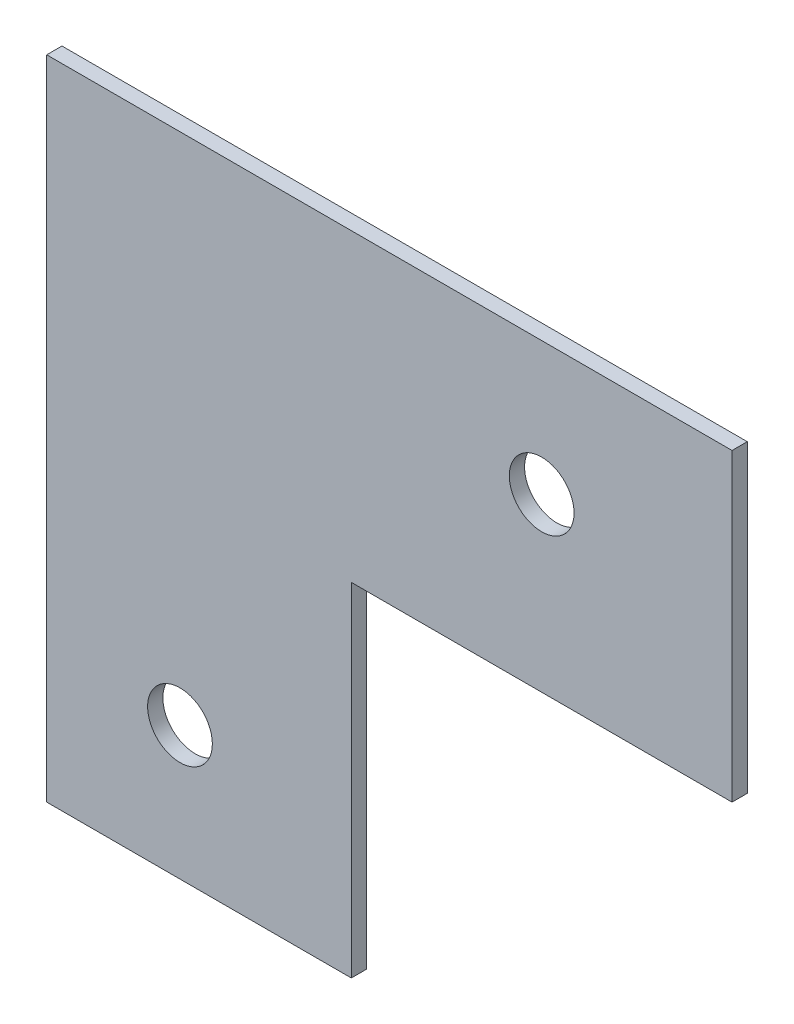
ISO-10303-21;
HEADER;
FILE_DESCRIPTION(('STEP AP214'),'2;1');
FILE_NAME('part.step','',(''),(''),'','','');
FILE_SCHEMA(('AUTOMOTIVE_DESIGN { 1 0 10303 214 1 1 1 1 }'));
ENDSEC;
DATA;
#1=APPLICATION_CONTEXT('core data for automotive mechanical design processes');
#2=APPLICATION_PROTOCOL_DEFINITION('international standard','automotive_design',2000,#1);
#3=PRODUCT_CONTEXT('',#1,'mechanical');
#4=PRODUCT('Part','Part','',(#3));
#5=PRODUCT_RELATED_PRODUCT_CATEGORY('part','',(#4));
#6=PRODUCT_DEFINITION_FORMATION('','',#4);
#7=PRODUCT_DEFINITION_CONTEXT('part definition',#1,'design');
#8=PRODUCT_DEFINITION('design','',#6,#7);
#9=PRODUCT_DEFINITION_SHAPE('','',#8);
#10=(LENGTH_UNIT() NAMED_UNIT(*) SI_UNIT(.MILLI.,.METRE.));
#11=(NAMED_UNIT(*) PLANE_ANGLE_UNIT() SI_UNIT($,.RADIAN.));
#12=(NAMED_UNIT(*) SI_UNIT($,.STERADIAN.) SOLID_ANGLE_UNIT());
#13=UNCERTAINTY_MEASURE_WITH_UNIT(LENGTH_MEASURE(1.E-05),#10,'distance_accuracy_value','');
#14=(GEOMETRIC_REPRESENTATION_CONTEXT(3) GLOBAL_UNCERTAINTY_ASSIGNED_CONTEXT((#13)) GLOBAL_UNIT_ASSIGNED_CONTEXT((#10,
#11,#12)) REPRESENTATION_CONTEXT('',''));
#15=CARTESIAN_POINT('',(0.,0.,0.));
#16=DIRECTION('',(0.,0.,1.));
#17=DIRECTION('',(1.,0.,0.));
#18=AXIS2_PLACEMENT_3D('',#15,#16,#17);
#19=CARTESIAN_POINT('',(40.,-45.,2.));
#20=DIRECTION('',(0.,1.,0.));
#21=DIRECTION('',(0.,0.,1.));
#22=AXIS2_PLACEMENT_3D('',#19,#20,#21);
#23=PLANE('',#22);
#24=DIRECTION('',(1.,0.,0.));
#25=VECTOR('',#24,1.);
#26=CARTESIAN_POINT('',(40.,-45.,0.));
#27=LINE('',#26,#25);
#28=CARTESIAN_POINT('',(0.,-45.,0.));
#29=VERTEX_POINT('',#28);
#30=CARTESIAN_POINT('',(40.,-45.,0.));
#31=VERTEX_POINT('',#30);
#32=EDGE_CURVE('E120',#29,#31,#27,.T.);
#33=ORIENTED_EDGE('',*,*,#32,.T.);
#34=DIRECTION('',(0.,0.,-1.));
#35=VECTOR('',#34,1.);
#36=CARTESIAN_POINT('',(40.,-45.,2.));
#37=LINE('',#36,#35);
#38=CARTESIAN_POINT('',(40.,-45.,2.));
#39=VERTEX_POINT('',#38);
#40=EDGE_CURVE('E40',#39,#31,#37,.T.);
#41=ORIENTED_EDGE('',*,*,#40,.F.);
#42=DIRECTION('',(1.,0.,0.));
#43=VECTOR('',#42,1.);
#44=CARTESIAN_POINT('',(40.,-45.,2.));
#45=LINE('',#44,#43);
#46=CARTESIAN_POINT('',(0.,-45.,2.));
#47=VERTEX_POINT('',#46);
#48=EDGE_CURVE('E86',#47,#39,#45,.T.);
#49=ORIENTED_EDGE('',*,*,#48,.F.);
#50=DIRECTION('',(0.,0.,-1.));
#51=VECTOR('',#50,1.);
#52=CARTESIAN_POINT('',(0.,-45.,2.));
#53=LINE('',#52,#51);
#54=EDGE_CURVE('E11',#47,#29,#53,.T.);
#55=ORIENTED_EDGE('',*,*,#54,.T.);
#56=EDGE_LOOP('',(#33,#41,#49,#55));
#57=FACE_BOUND('',#56,.T.);
#58=ADVANCED_FACE('F32',(#57),#23,.F.);
#59=CARTESIAN_POINT('',(40.,0.,2.));
#60=DIRECTION('',(-1.,0.,0.));
#61=DIRECTION('',(0.,-1.,0.));
#62=AXIS2_PLACEMENT_3D('',#59,#60,#61);
#63=PLANE('',#62);
#64=DIRECTION('',(0.,1.,0.));
#65=VECTOR('',#64,1.);
#66=CARTESIAN_POINT('',(40.,0.,0.));
#67=LINE('',#66,#65);
#68=CARTESIAN_POINT('',(40.,0.,0.));
#69=VERTEX_POINT('',#68);
#70=EDGE_CURVE('E122',#31,#69,#67,.T.);
#71=ORIENTED_EDGE('',*,*,#70,.T.);
#72=DIRECTION('',(0.,0.,-1.));
#73=VECTOR('',#72,1.);
#74=CARTESIAN_POINT('',(40.,0.,2.));
#75=LINE('',#74,#73);
#76=CARTESIAN_POINT('',(40.,0.,2.));
#77=VERTEX_POINT('',#76);
#78=EDGE_CURVE('E109',#77,#69,#75,.T.);
#79=ORIENTED_EDGE('',*,*,#78,.F.);
#80=DIRECTION('',(0.,1.,0.));
#81=VECTOR('',#80,1.);
#82=CARTESIAN_POINT('',(40.,0.,2.));
#83=LINE('',#82,#81);
#84=EDGE_CURVE('E100',#39,#77,#83,.T.);
#85=ORIENTED_EDGE('',*,*,#84,.F.);
#86=ORIENTED_EDGE('',*,*,#40,.T.);
#87=EDGE_LOOP('',(#71,#79,#85,#86));
#88=FACE_BOUND('',#87,.T.);
#89=ADVANCED_FACE('F135',(#88),#63,.F.);
#90=CARTESIAN_POINT('',(40.,0.,2.));
#91=DIRECTION('',(0.,1.,0.));
#92=DIRECTION('',(0.,0.,1.));
#93=AXIS2_PLACEMENT_3D('',#90,#91,#92);
#94=PLANE('',#93);
#95=DIRECTION('',(1.,0.,0.));
#96=VECTOR('',#95,1.);
#97=CARTESIAN_POINT('',(40.,0.,0.));
#98=LINE('',#97,#96);
#99=CARTESIAN_POINT('',(90.,0.,0.));
#100=VERTEX_POINT('',#99);
#101=EDGE_CURVE('E108',#69,#100,#98,.T.);
#102=ORIENTED_EDGE('',*,*,#101,.T.);
#103=DIRECTION('',(0.,0.,-1.));
#104=VECTOR('',#103,1.);
#105=CARTESIAN_POINT('',(90.,0.,2.));
#106=LINE('',#105,#104);
#107=CARTESIAN_POINT('',(90.,0.,2.));
#108=VERTEX_POINT('',#107);
#109=EDGE_CURVE('E105',#108,#100,#106,.T.);
#110=ORIENTED_EDGE('',*,*,#109,.F.);
#111=DIRECTION('',(1.,0.,0.));
#112=VECTOR('',#111,1.);
#113=CARTESIAN_POINT('',(40.,0.,2.));
#114=LINE('',#113,#112);
#115=EDGE_CURVE('E94',#77,#108,#114,.T.);
#116=ORIENTED_EDGE('',*,*,#115,.F.);
#117=ORIENTED_EDGE('',*,*,#78,.T.);
#118=EDGE_LOOP('',(#102,#110,#116,#117));
#119=FACE_BOUND('',#118,.T.);
#120=ADVANCED_FACE('F106',(#119),#94,.F.);
#121=CARTESIAN_POINT('',(90.,0.,2.));
#122=DIRECTION('',(-1.,0.,0.));
#123=DIRECTION('',(0.,0.,1.));
#124=AXIS2_PLACEMENT_3D('',#121,#122,#123);
#125=PLANE('',#124);
#126=DIRECTION('',(0.,1.,0.));
#127=VECTOR('',#126,1.);
#128=CARTESIAN_POINT('',(90.,0.,0.));
#129=LINE('',#128,#127);
#130=CARTESIAN_POINT('',(90.,40.,0.));
#131=VERTEX_POINT('',#130);
#132=EDGE_CURVE('E72',#100,#131,#129,.T.);
#133=ORIENTED_EDGE('',*,*,#132,.T.);
#134=DIRECTION('',(0.,0.,-1.));
#135=VECTOR('',#134,1.);
#136=CARTESIAN_POINT('',(90.,40.,2.));
#137=LINE('',#136,#135);
#138=CARTESIAN_POINT('',(90.,40.,2.));
#139=VERTEX_POINT('',#138);
#140=EDGE_CURVE('E110',#139,#131,#137,.T.);
#141=ORIENTED_EDGE('',*,*,#140,.F.);
#142=DIRECTION('',(0.,1.,0.));
#143=VECTOR('',#142,1.);
#144=CARTESIAN_POINT('',(90.,0.,2.));
#145=LINE('',#144,#143);
#146=EDGE_CURVE('E98',#108,#139,#145,.T.);
#147=ORIENTED_EDGE('',*,*,#146,.F.);
#148=ORIENTED_EDGE('',*,*,#109,.T.);
#149=EDGE_LOOP('',(#133,#141,#147,#148));
#150=FACE_BOUND('',#149,.T.);
#151=ADVANCED_FACE('F112',(#150),#125,.F.);
#152=CARTESIAN_POINT('',(90.,40.,2.));
#153=DIRECTION('',(0.,-1.,0.));
#154=DIRECTION('',(1.,0.,0.));
#155=AXIS2_PLACEMENT_3D('',#152,#153,#154);
#156=PLANE('',#155);
#157=DIRECTION('',(-1.,0.,0.));
#158=VECTOR('',#157,1.);
#159=CARTESIAN_POINT('',(90.,40.,0.));
#160=LINE('',#159,#158);
#161=CARTESIAN_POINT('',(0.,40.,0.));
#162=VERTEX_POINT('',#161);
#163=EDGE_CURVE('E79',#131,#162,#160,.T.);
#164=ORIENTED_EDGE('',*,*,#163,.T.);
#165=DIRECTION('',(0.,0.,-1.));
#166=VECTOR('',#165,1.);
#167=CARTESIAN_POINT('',(0.,40.,2.));
#168=LINE('',#167,#166);
#169=CARTESIAN_POINT('',(0.,40.,2.));
#170=VERTEX_POINT('',#169);
#171=EDGE_CURVE('E116',#170,#162,#168,.T.);
#172=ORIENTED_EDGE('',*,*,#171,.F.);
#173=DIRECTION('',(-1.,0.,0.));
#174=VECTOR('',#173,1.);
#175=CARTESIAN_POINT('',(90.,40.,2.));
#176=LINE('',#175,#174);
#177=EDGE_CURVE('E114',#139,#170,#176,.T.);
#178=ORIENTED_EDGE('',*,*,#177,.F.);
#179=ORIENTED_EDGE('',*,*,#140,.T.);
#180=EDGE_LOOP('',(#164,#172,#178,#179));
#181=FACE_BOUND('',#180,.T.);
#182=ADVANCED_FACE('F141',(#181),#156,.F.);
#183=CARTESIAN_POINT('',(0.,40.,2.));
#184=DIRECTION('',(1.,0.,0.));
#185=DIRECTION('',(0.,0.,-1.));
#186=AXIS2_PLACEMENT_3D('',#183,#184,#185);
#187=PLANE('',#186);
#188=DIRECTION('',(0.,-1.,0.));
#189=VECTOR('',#188,1.);
#190=CARTESIAN_POINT('',(0.,40.,0.));
#191=LINE('',#190,#189);
#192=EDGE_CURVE('E128',#162,#29,#191,.T.);
#193=ORIENTED_EDGE('',*,*,#192,.T.);
#194=ORIENTED_EDGE('',*,*,#54,.F.);
#195=DIRECTION('',(0.,-1.,0.));
#196=VECTOR('',#195,1.);
#197=CARTESIAN_POINT('',(0.,-45.,2.));
#198=LINE('',#197,#196);
#199=EDGE_CURVE('E48',#170,#47,#198,.T.);
#200=ORIENTED_EDGE('',*,*,#199,.F.);
#201=ORIENTED_EDGE('',*,*,#171,.T.);
#202=EDGE_LOOP('',(#193,#194,#200,#201));
#203=FACE_BOUND('',#202,.T.);
#204=ADVANCED_FACE('F140',(#203),#187,.F.);
#205=CARTESIAN_POINT('',(0.,40.,2.));
#206=DIRECTION('',(0.,0.,1.));
#207=DIRECTION('',(1.,0.,0.));
#208=AXIS2_PLACEMENT_3D('',#205,#206,#207);
#209=PLANE('',#208);
#210=CARTESIAN_POINT('',(65.,22.5,2.));
#211=DIRECTION('',(0.,0.,1.));
#212=DIRECTION('',(1.,0.,0.));
#213=AXIS2_PLACEMENT_3D('',#210,#211,#212);
#214=CIRCLE('',#213,4.25);
#215=CARTESIAN_POINT('',(69.25,22.5,2.));
#216=VERTEX_POINT('',#215);
#217=EDGE_CURVE('E153',#216,#216,#214,.T.);
#218=ORIENTED_EDGE('',*,*,#217,.F.);
#219=EDGE_LOOP('',(#218));
#220=FACE_BOUND('',#219,.T.);
#221=CARTESIAN_POINT('',(17.5,-27.5,2.));
#222=DIRECTION('',(0.,0.,1.));
#223=DIRECTION('',(1.,0.,0.));
#224=AXIS2_PLACEMENT_3D('',#221,#222,#223);
#225=CIRCLE('',#224,4.25);
#226=CARTESIAN_POINT('',(21.75,-27.5,2.));
#227=VERTEX_POINT('',#226);
#228=EDGE_CURVE('E147',#227,#227,#225,.T.);
#229=ORIENTED_EDGE('',*,*,#228,.F.);
#230=EDGE_LOOP('',(#229));
#231=FACE_BOUND('',#230,.T.);
#232=ORIENTED_EDGE('',*,*,#199,.T.);
#233=ORIENTED_EDGE('',*,*,#48,.T.);
#234=ORIENTED_EDGE('',*,*,#84,.T.);
#235=ORIENTED_EDGE('',*,*,#115,.T.);
#236=ORIENTED_EDGE('',*,*,#146,.T.);
#237=ORIENTED_EDGE('',*,*,#177,.T.);
#238=EDGE_LOOP('',(#232,#233,#234,#235,#236,#237));
#239=FACE_BOUND('',#238,.T.);
#240=ADVANCED_FACE('F96',(#220,#231,#239),#209,.T.);
#241=CARTESIAN_POINT('',(0.,40.,0.));
#242=DIRECTION('',(0.,0.,1.));
#243=DIRECTION('',(1.,0.,0.));
#244=AXIS2_PLACEMENT_3D('',#241,#242,#243);
#245=PLANE('',#244);
#246=CARTESIAN_POINT('',(65.,22.5,0.));
#247=DIRECTION('',(0.,0.,1.));
#248=DIRECTION('',(1.,0.,0.));
#249=AXIS2_PLACEMENT_3D('',#246,#247,#248);
#250=CIRCLE('',#249,4.25);
#251=CARTESIAN_POINT('',(69.25,22.5,0.));
#252=VERTEX_POINT('',#251);
#253=EDGE_CURVE('E150',#252,#252,#250,.F.);
#254=ORIENTED_EDGE('',*,*,#253,.F.);
#255=EDGE_LOOP('',(#254));
#256=FACE_BOUND('',#255,.T.);
#257=CARTESIAN_POINT('',(17.5,-27.5,0.));
#258=DIRECTION('',(0.,0.,1.));
#259=DIRECTION('',(1.,0.,0.));
#260=AXIS2_PLACEMENT_3D('',#257,#258,#259);
#261=CIRCLE('',#260,4.25);
#262=CARTESIAN_POINT('',(21.75,-27.5,0.));
#263=VERTEX_POINT('',#262);
#264=EDGE_CURVE('E123',#263,#263,#261,.F.);
#265=ORIENTED_EDGE('',*,*,#264,.F.);
#266=EDGE_LOOP('',(#265));
#267=FACE_BOUND('',#266,.T.);
#268=ORIENTED_EDGE('',*,*,#32,.F.);
#269=ORIENTED_EDGE('',*,*,#192,.F.);
#270=ORIENTED_EDGE('',*,*,#163,.F.);
#271=ORIENTED_EDGE('',*,*,#132,.F.);
#272=ORIENTED_EDGE('',*,*,#101,.F.);
#273=ORIENTED_EDGE('',*,*,#70,.F.);
#274=EDGE_LOOP('',(#268,#269,#270,#271,#272,#273));
#275=FACE_BOUND('',#274,.T.);
#276=ADVANCED_FACE('F138',(#256,#267,#275),#245,.F.);
#277=CARTESIAN_POINT('',(17.5,-27.5,-0.00100000000000013));
#278=DIRECTION('',(0.,0.,1.));
#279=DIRECTION('',(1.,0.,0.));
#280=AXIS2_PLACEMENT_3D('',#277,#278,#279);
#281=CYLINDRICAL_SURFACE('',#280,4.25);
#282=ORIENTED_EDGE('',*,*,#228,.T.);
#283=EDGE_LOOP('',(#282));
#284=FACE_BOUND('',#283,.T.);
#285=ORIENTED_EDGE('',*,*,#264,.T.);
#286=EDGE_LOOP('',(#285));
#287=FACE_BOUND('',#286,.T.);
#288=ADVANCED_FACE('F165',(#284,#287),#281,.F.);
#289=CARTESIAN_POINT('',(65.,22.5,-0.00100000000000013));
#290=DIRECTION('',(0.,0.,1.));
#291=DIRECTION('',(1.,0.,0.));
#292=AXIS2_PLACEMENT_3D('',#289,#290,#291);
#293=CYLINDRICAL_SURFACE('',#292,4.25);
#294=ORIENTED_EDGE('',*,*,#217,.T.);
#295=EDGE_LOOP('',(#294));
#296=FACE_BOUND('',#295,.T.);
#297=ORIENTED_EDGE('',*,*,#253,.T.);
#298=EDGE_LOOP('',(#297));
#299=FACE_BOUND('',#298,.T.);
#300=ADVANCED_FACE('F157',(#296,#299),#293,.F.);
#301=CLOSED_SHELL('',(#58,#89,#120,#151,#182,#204,#240,#276,#288,#300));
#302=MANIFOLD_SOLID_BREP('B2',#301);
#303=ADVANCED_BREP_SHAPE_REPRESENTATION('',(#18,#302),#14);
#304=SHAPE_DEFINITION_REPRESENTATION(#9,#303);
ENDSEC;
END-ISO-10303-21;
